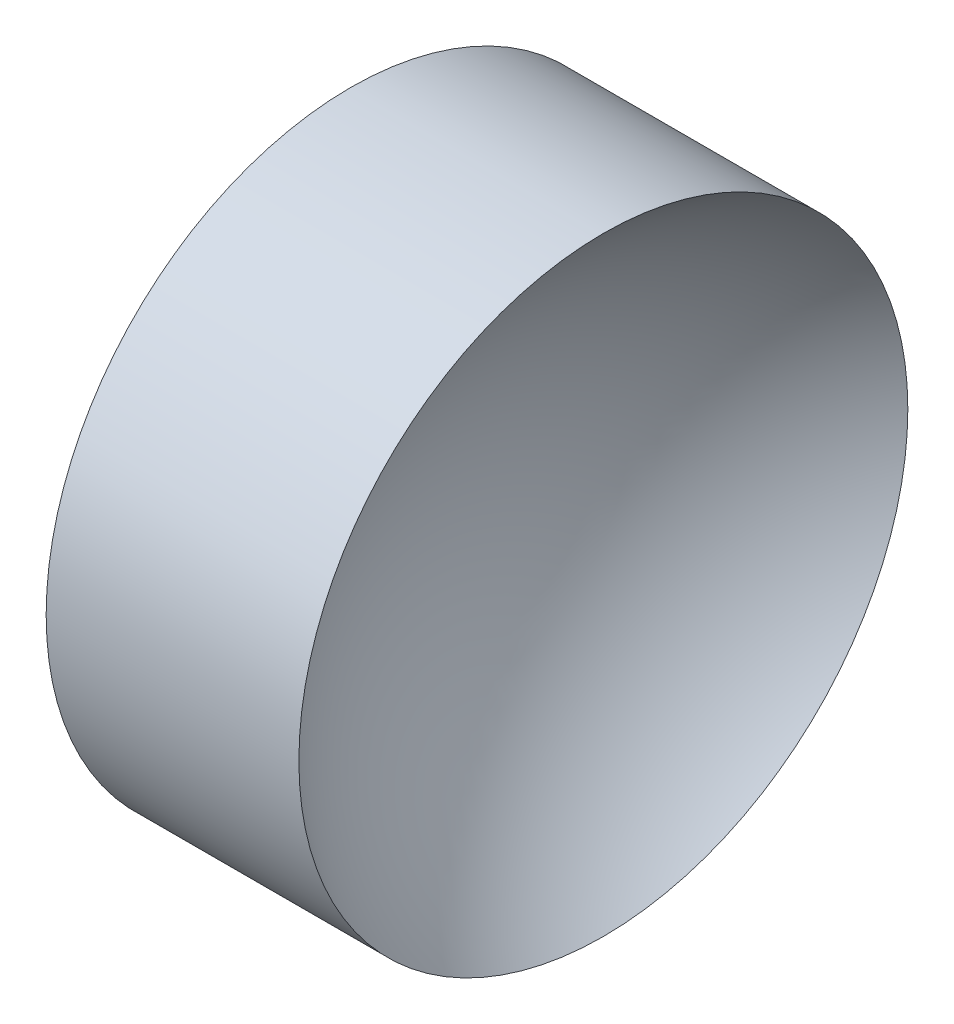
ISO-10303-21;
HEADER;
FILE_DESCRIPTION(('STEP AP214'),'2;1');
FILE_NAME('part.step','',(''),(''),'','','');
FILE_SCHEMA(('AUTOMOTIVE_DESIGN { 1 0 10303 214 1 1 1 1 }'));
ENDSEC;
DATA;
#1=APPLICATION_CONTEXT('core data for automotive mechanical design processes');
#2=APPLICATION_PROTOCOL_DEFINITION('international standard','automotive_design',2000,#1);
#3=PRODUCT_CONTEXT('',#1,'mechanical');
#4=PRODUCT('Part','Part','',(#3));
#5=PRODUCT_RELATED_PRODUCT_CATEGORY('part','',(#4));
#6=PRODUCT_DEFINITION_FORMATION('','',#4);
#7=PRODUCT_DEFINITION_CONTEXT('part definition',#1,'design');
#8=PRODUCT_DEFINITION('design','',#6,#7);
#9=PRODUCT_DEFINITION_SHAPE('','',#8);
#10=(LENGTH_UNIT() NAMED_UNIT(*) SI_UNIT(.MILLI.,.METRE.));
#11=(NAMED_UNIT(*) PLANE_ANGLE_UNIT() SI_UNIT($,.RADIAN.));
#12=(NAMED_UNIT(*) SI_UNIT($,.STERADIAN.) SOLID_ANGLE_UNIT());
#13=UNCERTAINTY_MEASURE_WITH_UNIT(LENGTH_MEASURE(1.E-05),#10,'distance_accuracy_value','');
#14=(GEOMETRIC_REPRESENTATION_CONTEXT(3) GLOBAL_UNCERTAINTY_ASSIGNED_CONTEXT((#13)) GLOBAL_UNIT_ASSIGNED_CONTEXT((#10,
#11,#12)) REPRESENTATION_CONTEXT('',''));
#15=CARTESIAN_POINT('',(0.,0.,0.));
#16=DIRECTION('',(0.,0.,1.));
#17=DIRECTION('',(1.,0.,0.));
#18=AXIS2_PLACEMENT_3D('',#15,#16,#17);
#19=CARTESIAN_POINT('',(57.5447110158185,28.4775956346375,0.));
#20=DIRECTION('',(-1.,0.,0.));
#21=DIRECTION('',(0.,-1.,0.));
#22=AXIS2_PLACEMENT_3D('',#19,#20,#21);
#23=SPHERICAL_SURFACE('',#22,7.80000000000001);
#24=CARTESIAN_POINT('',(53.0150863073023,28.4775956346375,0.));
#25=DIRECTION('',(-1.,0.,0.));
#26=DIRECTION('',(0.,0.,1.));
#27=AXIS2_PLACEMENT_3D('',#24,#25,#26);
#28=CIRCLE('',#27,6.34999999999999);
#29=CARTESIAN_POINT('',(53.0150863073023,28.4775956346375,6.34999999999999));
#30=VERTEX_POINT('',#29);
#31=EDGE_CURVE('E10',#30,#30,#28,.T.);
#32=ORIENTED_EDGE('',*,*,#31,.F.);
#33=EDGE_LOOP('',(#32));
#34=FACE_BOUND('',#33,.T.);
#35=ADVANCED_FACE('F35',(#34),#23,.F.);
#36=CARTESIAN_POINT('',(44.7820919030242,28.4775956346375,0.));
#37=DIRECTION('',(-1.,0.,0.));
#38=DIRECTION('',(0.,0.,1.));
#39=AXIS2_PLACEMENT_3D('',#36,#37,#38);
#40=CYLINDRICAL_SURFACE('',#39,6.35);
#41=CARTESIAN_POINT('',(47.7447110158185,28.4775956346375,0.));
#42=DIRECTION('',(-1.,0.,0.));
#43=DIRECTION('',(0.,0.,1.));
#44=AXIS2_PLACEMENT_3D('',#41,#42,#43);
#45=CIRCLE('',#44,6.35);
#46=CARTESIAN_POINT('',(47.7447110158185,28.4775956346375,6.35));
#47=VERTEX_POINT('',#46);
#48=EDGE_CURVE('E41',#47,#47,#45,.T.);
#49=ORIENTED_EDGE('',*,*,#48,.F.);
#50=EDGE_LOOP('',(#49));
#51=FACE_BOUND('',#50,.T.);
#52=ORIENTED_EDGE('',*,*,#31,.T.);
#53=EDGE_LOOP('',(#52));
#54=FACE_BOUND('',#53,.T.);
#55=ADVANCED_FACE('F49',(#51,#54),#40,.T.);
#56=CARTESIAN_POINT('',(47.7447110158185,28.4775956346375,0.));
#57=DIRECTION('',(1.,0.,0.));
#58=DIRECTION('',(0.,0.,-1.));
#59=AXIS2_PLACEMENT_3D('',#56,#57,#58);
#60=PLANE('',#59);
#61=ORIENTED_EDGE('',*,*,#48,.T.);
#62=EDGE_LOOP('',(#61));
#63=FACE_BOUND('',#62,.T.);
#64=ADVANCED_FACE('F47',(#63),#60,.F.);
#65=CLOSED_SHELL('',(#35,#55,#64));
#66=MANIFOLD_SOLID_BREP('B2',#65);
#67=ADVANCED_BREP_SHAPE_REPRESENTATION('',(#18,#66),#14);
#68=SHAPE_DEFINITION_REPRESENTATION(#9,#67);
ENDSEC;
END-ISO-10303-21;
